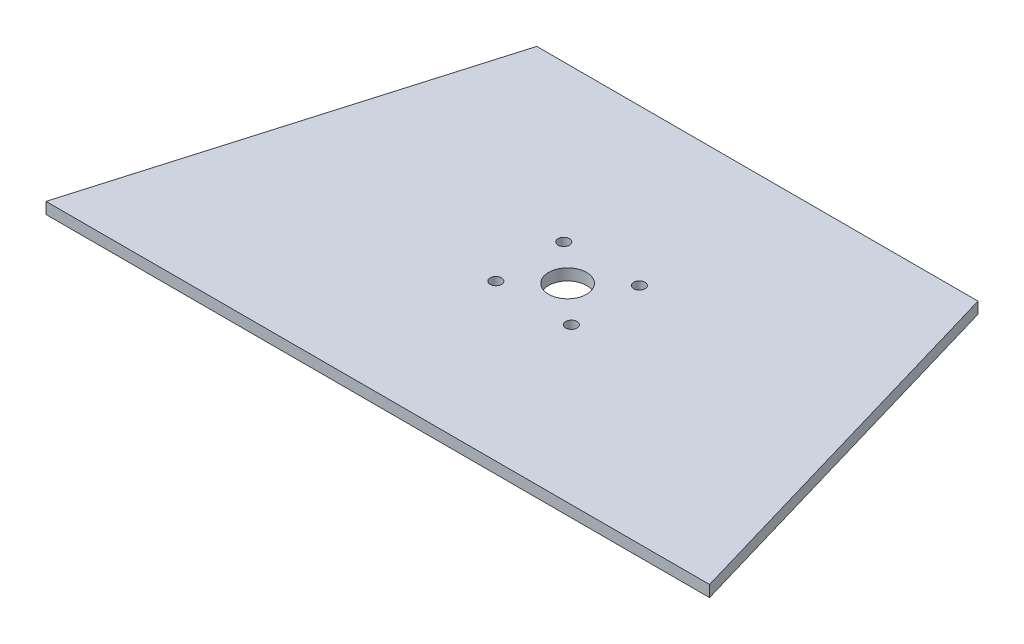
ISO-10303-21;
HEADER;
FILE_DESCRIPTION(('STEP AP214'),'2;1');
FILE_NAME('part.step','',(''),(''),'','','');
FILE_SCHEMA(('AUTOMOTIVE_DESIGN { 1 0 10303 214 1 1 1 1 }'));
ENDSEC;
DATA;
#1=APPLICATION_CONTEXT('core data for automotive mechanical design processes');
#2=APPLICATION_PROTOCOL_DEFINITION('international standard','automotive_design',2000,#1);
#3=PRODUCT_CONTEXT('',#1,'mechanical');
#4=PRODUCT('Part','Part','',(#3));
#5=PRODUCT_RELATED_PRODUCT_CATEGORY('part','',(#4));
#6=PRODUCT_DEFINITION_FORMATION('','',#4);
#7=PRODUCT_DEFINITION_CONTEXT('part definition',#1,'design');
#8=PRODUCT_DEFINITION('design','',#6,#7);
#9=PRODUCT_DEFINITION_SHAPE('','',#8);
#10=(LENGTH_UNIT() NAMED_UNIT(*) SI_UNIT(.MILLI.,.METRE.));
#11=(NAMED_UNIT(*) PLANE_ANGLE_UNIT() SI_UNIT($,.RADIAN.));
#12=(NAMED_UNIT(*) SI_UNIT($,.STERADIAN.) SOLID_ANGLE_UNIT());
#13=UNCERTAINTY_MEASURE_WITH_UNIT(LENGTH_MEASURE(1.E-05),#10,'distance_accuracy_value','');
#14=(GEOMETRIC_REPRESENTATION_CONTEXT(3) GLOBAL_UNCERTAINTY_ASSIGNED_CONTEXT((#13)) GLOBAL_UNIT_ASSIGNED_CONTEXT((#10,
#11,#12)) REPRESENTATION_CONTEXT('',''));
#15=CARTESIAN_POINT('',(0.,0.,0.));
#16=DIRECTION('',(0.,0.,1.));
#17=DIRECTION('',(1.,0.,0.));
#18=AXIS2_PLACEMENT_3D('',#15,#16,#17);
#19=CARTESIAN_POINT('',(5.19999999999998,3.,0.));
#20=DIRECTION('',(0.959707262339068,0.,0.281001727065248));
#21=DIRECTION('',(0.281001727065248,0.,-0.959707262339068));
#22=AXIS2_PLACEMENT_3D('',#19,#20,#21);
#23=PLANE('',#22);
#24=DIRECTION('',(-0.281001727065247,0.,0.959707262339068));
#25=VECTOR('',#24,1.);
#26=CARTESIAN_POINT('',(5.19999999999998,0.,0.));
#27=LINE('',#26,#25);
#28=CARTESIAN_POINT('',(34.4799417168491,0.,-100.));
#29=VERTEX_POINT('',#28);
#30=CARTESIAN_POINT('',(5.19999999999998,0.,0.));
#31=VERTEX_POINT('',#30);
#32=EDGE_CURVE('E103',#29,#31,#27,.T.);
#33=ORIENTED_EDGE('',*,*,#32,.T.);
#34=DIRECTION('',(0.,-1.,0.));
#35=VECTOR('',#34,1.);
#36=CARTESIAN_POINT('',(5.19999999999998,3.,0.));
#37=LINE('',#36,#35);
#38=CARTESIAN_POINT('',(5.19999999999998,3.,0.));
#39=VERTEX_POINT('',#38);
#40=EDGE_CURVE('E11',#39,#31,#37,.T.);
#41=ORIENTED_EDGE('',*,*,#40,.F.);
#42=DIRECTION('',(-0.281001727065247,0.,0.959707262339068));
#43=VECTOR('',#42,1.);
#44=CARTESIAN_POINT('',(5.19999999999998,3.,0.));
#45=LINE('',#44,#43);
#46=CARTESIAN_POINT('',(34.4799417168491,3.,-100.));
#47=VERTEX_POINT('',#46);
#48=EDGE_CURVE('E91',#47,#39,#45,.T.);
#49=ORIENTED_EDGE('',*,*,#48,.F.);
#50=DIRECTION('',(0.,-1.,0.));
#51=VECTOR('',#50,1.);
#52=CARTESIAN_POINT('',(34.4799417168491,3.,-100.));
#53=LINE('',#52,#51);
#54=EDGE_CURVE('E99',#47,#29,#53,.T.);
#55=ORIENTED_EDGE('',*,*,#54,.T.);
#56=EDGE_LOOP('',(#33,#41,#49,#55));
#57=FACE_BOUND('',#56,.T.);
#58=ADVANCED_FACE('F40',(#57),#23,.F.);
#59=CARTESIAN_POINT('',(5.19999999999998,3.,0.));
#60=DIRECTION('',(0.,0.,-1.));
#61=DIRECTION('',(-1.,0.,0.));
#62=AXIS2_PLACEMENT_3D('',#59,#60,#61);
#63=PLANE('',#62);
#64=DIRECTION('',(1.,0.,0.));
#65=VECTOR('',#64,1.);
#66=CARTESIAN_POINT('',(5.19999999999998,0.,0.));
#67=LINE('',#66,#65);
#68=CARTESIAN_POINT('',(180.,0.,0.));
#69=VERTEX_POINT('',#68);
#70=EDGE_CURVE('E95',#31,#69,#67,.T.);
#71=ORIENTED_EDGE('',*,*,#70,.T.);
#72=DIRECTION('',(0.,-1.,0.));
#73=VECTOR('',#72,1.);
#74=CARTESIAN_POINT('',(180.,3.,0.));
#75=LINE('',#74,#73);
#76=CARTESIAN_POINT('',(180.,3.,0.));
#77=VERTEX_POINT('',#76);
#78=EDGE_CURVE('E48',#77,#69,#75,.T.);
#79=ORIENTED_EDGE('',*,*,#78,.F.);
#80=DIRECTION('',(1.,0.,0.));
#81=VECTOR('',#80,1.);
#82=CARTESIAN_POINT('',(5.19999999999998,3.,0.));
#83=LINE('',#82,#81);
#84=EDGE_CURVE('E86',#39,#77,#83,.T.);
#85=ORIENTED_EDGE('',*,*,#84,.F.);
#86=ORIENTED_EDGE('',*,*,#40,.T.);
#87=EDGE_LOOP('',(#71,#79,#85,#86));
#88=FACE_BOUND('',#87,.T.);
#89=ADVANCED_FACE('F94',(#88),#63,.F.);
#90=CARTESIAN_POINT('',(180.,3.,0.));
#91=DIRECTION('',(-0.959707262339066,0.,0.281001727065255));
#92=DIRECTION('',(0.281001727065255,0.,0.959707262339066));
#93=AXIS2_PLACEMENT_3D('',#90,#91,#92);
#94=PLANE('',#93);
#95=DIRECTION('',(-0.281001727065255,0.,-0.959707262339066));
#96=VECTOR('',#95,1.);
#97=CARTESIAN_POINT('',(180.,0.,0.));
#98=LINE('',#97,#96);
#99=CARTESIAN_POINT('',(150.72005828315,0.,-100.));
#100=VERTEX_POINT('',#99);
#101=EDGE_CURVE('E73',#69,#100,#98,.T.);
#102=ORIENTED_EDGE('',*,*,#101,.T.);
#103=DIRECTION('',(0.,-1.,0.));
#104=VECTOR('',#103,1.);
#105=CARTESIAN_POINT('',(150.72005828315,3.,-100.));
#106=LINE('',#105,#104);
#107=CARTESIAN_POINT('',(150.72005828315,3.,-100.));
#108=VERTEX_POINT('',#107);
#109=EDGE_CURVE('E96',#108,#100,#106,.T.);
#110=ORIENTED_EDGE('',*,*,#109,.F.);
#111=DIRECTION('',(-0.281001727065255,0.,-0.959707262339066));
#112=VECTOR('',#111,1.);
#113=CARTESIAN_POINT('',(180.,3.,0.));
#114=LINE('',#113,#112);
#115=EDGE_CURVE('E89',#77,#108,#114,.T.);
#116=ORIENTED_EDGE('',*,*,#115,.F.);
#117=ORIENTED_EDGE('',*,*,#78,.T.);
#118=EDGE_LOOP('',(#102,#110,#116,#117));
#119=FACE_BOUND('',#118,.T.);
#120=ADVANCED_FACE('F97',(#119),#94,.F.);
#121=CARTESIAN_POINT('',(34.4799417168491,3.,-100.));
#122=DIRECTION('',(0.,0.,1.));
#123=DIRECTION('',(1.,0.,0.));
#124=AXIS2_PLACEMENT_3D('',#121,#122,#123);
#125=PLANE('',#124);
#126=DIRECTION('',(-1.,0.,0.));
#127=VECTOR('',#126,1.);
#128=CARTESIAN_POINT('',(34.4799417168491,0.,-100.));
#129=LINE('',#128,#127);
#130=EDGE_CURVE('E79',#100,#29,#129,.T.);
#131=ORIENTED_EDGE('',*,*,#130,.T.);
#132=ORIENTED_EDGE('',*,*,#54,.F.);
#133=DIRECTION('',(-1.,0.,0.));
#134=VECTOR('',#133,1.);
#135=CARTESIAN_POINT('',(34.4799417168491,3.,-100.));
#136=LINE('',#135,#134);
#137=EDGE_CURVE('E56',#108,#47,#136,.T.);
#138=ORIENTED_EDGE('',*,*,#137,.F.);
#139=ORIENTED_EDGE('',*,*,#109,.T.);
#140=EDGE_LOOP('',(#131,#132,#138,#139));
#141=FACE_BOUND('',#140,.T.);
#142=ADVANCED_FACE('F111',(#141),#125,.F.);
#143=CARTESIAN_POINT('',(0.,3.,0.));
#144=DIRECTION('',(0.,-1.,0.));
#145=DIRECTION('',(0.,0.,-1.));
#146=AXIS2_PLACEMENT_3D('',#143,#144,#145);
#147=PLANE('',#146);
#148=CARTESIAN_POINT('',(92.6,3.,-49.9999999999975));
#149=DIRECTION('',(0.,1.,0.));
#150=DIRECTION('',(0.,0.,1.));
#151=AXIS2_PLACEMENT_3D('',#148,#149,#150);
#152=CIRCLE('',#151,4.99999999999999);
#153=CARTESIAN_POINT('',(92.6,3.,-44.9999999999975));
#154=VERTEX_POINT('',#153);
#155=EDGE_CURVE('E143',#154,#154,#152,.T.);
#156=ORIENTED_EDGE('',*,*,#155,.F.);
#157=EDGE_LOOP('',(#156));
#158=FACE_BOUND('',#157,.T.);
#159=CARTESIAN_POINT('',(82.6499999999999,3.,-58.9499999999975));
#160=DIRECTION('',(0.,-1.,0.));
#161=DIRECTION('',(0.,0.,-1.));
#162=AXIS2_PLACEMENT_3D('',#159,#160,#161);
#163=CIRCLE('',#162,1.49999999999999);
#164=CARTESIAN_POINT('',(82.6499999999999,3.,-60.4499999999975));
#165=VERTEX_POINT('',#164);
#166=EDGE_CURVE('E134',#165,#165,#163,.T.);
#167=ORIENTED_EDGE('',*,*,#166,.T.);
#168=EDGE_LOOP('',(#167));
#169=FACE_BOUND('',#168,.T.);
#170=CARTESIAN_POINT('',(82.6500000000001,3.,-41.0499999999975));
#171=DIRECTION('',(0.,-1.,0.));
#172=DIRECTION('',(0.,0.,-1.));
#173=AXIS2_PLACEMENT_3D('',#170,#171,#172);
#174=CIRCLE('',#173,1.49999999999999);
#175=CARTESIAN_POINT('',(82.6500000000001,3.,-42.5499999999975));
#176=VERTEX_POINT('',#175);
#177=EDGE_CURVE('E128',#176,#176,#174,.T.);
#178=ORIENTED_EDGE('',*,*,#177,.T.);
#179=EDGE_LOOP('',(#178));
#180=FACE_BOUND('',#179,.T.);
#181=CARTESIAN_POINT('',(102.55,3.,-41.0499999999976));
#182=DIRECTION('',(0.,-1.,0.));
#183=DIRECTION('',(0.,0.,-1.));
#184=AXIS2_PLACEMENT_3D('',#181,#182,#183);
#185=CIRCLE('',#184,1.49999999999999);
#186=CARTESIAN_POINT('',(102.55,3.,-42.5499999999976));
#187=VERTEX_POINT('',#186);
#188=EDGE_CURVE('E122',#187,#187,#185,.T.);
#189=ORIENTED_EDGE('',*,*,#188,.T.);
#190=EDGE_LOOP('',(#189));
#191=FACE_BOUND('',#190,.T.);
#192=CARTESIAN_POINT('',(102.55,3.,-58.9499999999976));
#193=DIRECTION('',(0.,-1.,0.));
#194=DIRECTION('',(0.,0.,-1.));
#195=AXIS2_PLACEMENT_3D('',#192,#193,#194);
#196=CIRCLE('',#195,1.49999999999999);
#197=CARTESIAN_POINT('',(102.55,3.,-60.4499999999976));
#198=VERTEX_POINT('',#197);
#199=EDGE_CURVE('E106',#198,#198,#196,.T.);
#200=ORIENTED_EDGE('',*,*,#199,.T.);
#201=EDGE_LOOP('',(#200));
#202=FACE_BOUND('',#201,.T.);
#203=ORIENTED_EDGE('',*,*,#48,.T.);
#204=ORIENTED_EDGE('',*,*,#84,.T.);
#205=ORIENTED_EDGE('',*,*,#115,.T.);
#206=ORIENTED_EDGE('',*,*,#137,.T.);
#207=EDGE_LOOP('',(#203,#204,#205,#206));
#208=FACE_BOUND('',#207,.T.);
#209=ADVANCED_FACE('F87',(#158,#169,#180,#191,#202,#208),#147,.F.);
#210=CARTESIAN_POINT('',(0.,0.,0.));
#211=DIRECTION('',(0.,-1.,0.));
#212=DIRECTION('',(0.,0.,-1.));
#213=AXIS2_PLACEMENT_3D('',#210,#211,#212);
#214=PLANE('',#213);
#215=CARTESIAN_POINT('',(92.6,0.,-49.9999999999975));
#216=DIRECTION('',(0.,-1.,0.));
#217=DIRECTION('',(0.,0.,-1.));
#218=AXIS2_PLACEMENT_3D('',#215,#216,#217);
#219=CIRCLE('',#218,5.);
#220=CARTESIAN_POINT('',(92.6,0.,-54.9999999999975));
#221=VERTEX_POINT('',#220);
#222=EDGE_CURVE('E140',#221,#221,#219,.T.);
#223=ORIENTED_EDGE('',*,*,#222,.F.);
#224=EDGE_LOOP('',(#223));
#225=FACE_BOUND('',#224,.T.);
#226=CARTESIAN_POINT('',(82.6499999999999,0.,-58.9499999999975));
#227=DIRECTION('',(0.,-1.,0.));
#228=DIRECTION('',(0.,0.,-1.));
#229=AXIS2_PLACEMENT_3D('',#226,#227,#228);
#230=CIRCLE('',#229,1.49999999999999);
#231=CARTESIAN_POINT('',(82.6499999999999,0.,-60.4499999999975));
#232=VERTEX_POINT('',#231);
#233=EDGE_CURVE('E137',#232,#232,#230,.T.);
#234=ORIENTED_EDGE('',*,*,#233,.F.);
#235=EDGE_LOOP('',(#234));
#236=FACE_BOUND('',#235,.T.);
#237=CARTESIAN_POINT('',(82.6500000000001,0.,-41.0499999999975));
#238=DIRECTION('',(0.,-1.,0.));
#239=DIRECTION('',(0.,0.,-1.));
#240=AXIS2_PLACEMENT_3D('',#237,#238,#239);
#241=CIRCLE('',#240,1.49999999999999);
#242=CARTESIAN_POINT('',(82.6500000000001,0.,-42.5499999999975));
#243=VERTEX_POINT('',#242);
#244=EDGE_CURVE('E131',#243,#243,#241,.T.);
#245=ORIENTED_EDGE('',*,*,#244,.F.);
#246=EDGE_LOOP('',(#245));
#247=FACE_BOUND('',#246,.T.);
#248=CARTESIAN_POINT('',(102.55,0.,-41.0499999999976));
#249=DIRECTION('',(0.,-1.,0.));
#250=DIRECTION('',(0.,0.,-1.));
#251=AXIS2_PLACEMENT_3D('',#248,#249,#250);
#252=CIRCLE('',#251,1.49999999999999);
#253=CARTESIAN_POINT('',(102.55,0.,-42.5499999999976));
#254=VERTEX_POINT('',#253);
#255=EDGE_CURVE('E125',#254,#254,#252,.T.);
#256=ORIENTED_EDGE('',*,*,#255,.F.);
#257=EDGE_LOOP('',(#256));
#258=FACE_BOUND('',#257,.T.);
#259=CARTESIAN_POINT('',(102.55,0.,-58.9499999999976));
#260=DIRECTION('',(0.,-1.,0.));
#261=DIRECTION('',(0.,0.,-1.));
#262=AXIS2_PLACEMENT_3D('',#259,#260,#261);
#263=CIRCLE('',#262,1.49999999999999);
#264=CARTESIAN_POINT('',(102.55,0.,-60.4499999999976));
#265=VERTEX_POINT('',#264);
#266=EDGE_CURVE('E119',#265,#265,#263,.T.);
#267=ORIENTED_EDGE('',*,*,#266,.F.);
#268=EDGE_LOOP('',(#267));
#269=FACE_BOUND('',#268,.T.);
#270=ORIENTED_EDGE('',*,*,#32,.F.);
#271=ORIENTED_EDGE('',*,*,#130,.F.);
#272=ORIENTED_EDGE('',*,*,#101,.F.);
#273=ORIENTED_EDGE('',*,*,#70,.F.);
#274=EDGE_LOOP('',(#270,#271,#272,#273));
#275=FACE_BOUND('',#274,.T.);
#276=ADVANCED_FACE('F114',(#225,#236,#247,#258,#269,#275),#214,.T.);
#277=CARTESIAN_POINT('',(102.55,0.,-58.9499999999976));
#278=DIRECTION('',(0.,-1.,0.));
#279=DIRECTION('',(0.,0.,-1.));
#280=AXIS2_PLACEMENT_3D('',#277,#278,#279);
#281=CYLINDRICAL_SURFACE('',#280,1.49999999999999);
#282=ORIENTED_EDGE('',*,*,#199,.F.);
#283=EDGE_LOOP('',(#282));
#284=FACE_BOUND('',#283,.T.);
#285=ORIENTED_EDGE('',*,*,#266,.T.);
#286=EDGE_LOOP('',(#285));
#287=FACE_BOUND('',#286,.T.);
#288=ADVANCED_FACE('F161',(#284,#287),#281,.F.);
#289=CARTESIAN_POINT('',(102.55,0.,-41.0499999999976));
#290=DIRECTION('',(0.,-1.,0.));
#291=DIRECTION('',(0.,0.,-1.));
#292=AXIS2_PLACEMENT_3D('',#289,#290,#291);
#293=CYLINDRICAL_SURFACE('',#292,1.49999999999999);
#294=ORIENTED_EDGE('',*,*,#188,.F.);
#295=EDGE_LOOP('',(#294));
#296=FACE_BOUND('',#295,.T.);
#297=ORIENTED_EDGE('',*,*,#255,.T.);
#298=EDGE_LOOP('',(#297));
#299=FACE_BOUND('',#298,.T.);
#300=ADVANCED_FACE('F164',(#296,#299),#293,.F.);
#301=CARTESIAN_POINT('',(82.6500000000001,0.,-41.0499999999975));
#302=DIRECTION('',(0.,-1.,0.));
#303=DIRECTION('',(0.,0.,-1.));
#304=AXIS2_PLACEMENT_3D('',#301,#302,#303);
#305=CYLINDRICAL_SURFACE('',#304,1.49999999999999);
#306=ORIENTED_EDGE('',*,*,#177,.F.);
#307=EDGE_LOOP('',(#306));
#308=FACE_BOUND('',#307,.T.);
#309=ORIENTED_EDGE('',*,*,#244,.T.);
#310=EDGE_LOOP('',(#309));
#311=FACE_BOUND('',#310,.T.);
#312=ADVANCED_FACE('F219',(#308,#311),#305,.F.);
#313=CARTESIAN_POINT('',(82.6499999999999,0.,-58.9499999999975));
#314=DIRECTION('',(0.,-1.,0.));
#315=DIRECTION('',(0.,0.,-1.));
#316=AXIS2_PLACEMENT_3D('',#313,#314,#315);
#317=CYLINDRICAL_SURFACE('',#316,1.49999999999999);
#318=ORIENTED_EDGE('',*,*,#166,.F.);
#319=EDGE_LOOP('',(#318));
#320=FACE_BOUND('',#319,.T.);
#321=ORIENTED_EDGE('',*,*,#233,.T.);
#322=EDGE_LOOP('',(#321));
#323=FACE_BOUND('',#322,.T.);
#324=ADVANCED_FACE('F200',(#320,#323),#317,.F.);
#325=CARTESIAN_POINT('',(92.6,3.,-49.9999999999975));
#326=DIRECTION('',(0.,1.,0.));
#327=DIRECTION('',(0.,0.,1.));
#328=AXIS2_PLACEMENT_3D('',#325,#326,#327);
#329=CYLINDRICAL_SURFACE('',#328,5.);
#330=ORIENTED_EDGE('',*,*,#155,.T.);
#331=EDGE_LOOP('',(#330));
#332=FACE_BOUND('',#331,.T.);
#333=ORIENTED_EDGE('',*,*,#222,.T.);
#334=EDGE_LOOP('',(#333));
#335=FACE_BOUND('',#334,.T.);
#336=ADVANCED_FACE('F147',(#332,#335),#329,.F.);
#337=CLOSED_SHELL('',(#58,#89,#120,#142,#209,#276,#288,#300,#312,#324,#336));
#338=MANIFOLD_SOLID_BREP('B2',#337);
#339=ADVANCED_BREP_SHAPE_REPRESENTATION('',(#18,#338),#14);
#340=SHAPE_DEFINITION_REPRESENTATION(#9,#339);
ENDSEC;
END-ISO-10303-21;
